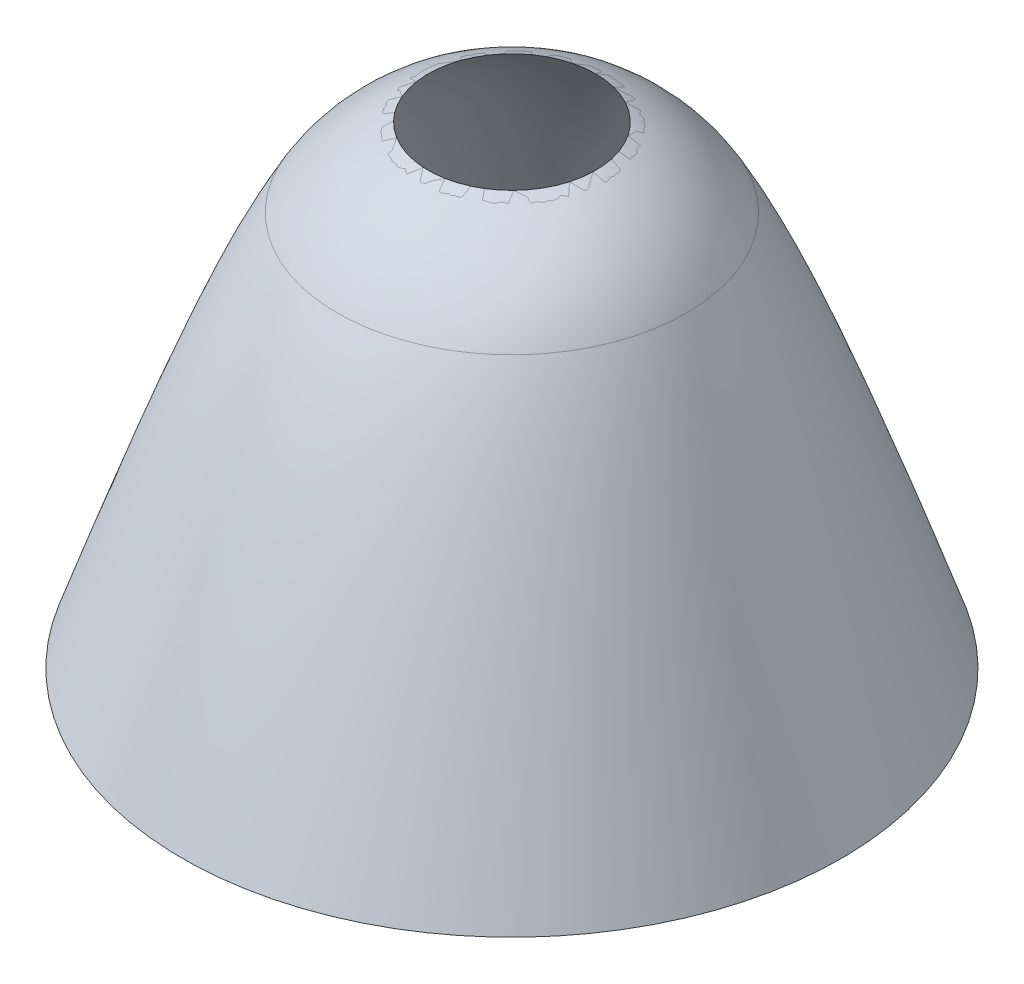
ISO-10303-21;
HEADER;
FILE_DESCRIPTION(('STEP AP214'),'2;1');
FILE_NAME('part.step','',(''),(''),'','','');
FILE_SCHEMA(('AUTOMOTIVE_DESIGN { 1 0 10303 214 1 1 1 1 }'));
ENDSEC;
DATA;
#1=APPLICATION_CONTEXT('core data for automotive mechanical design processes');
#2=APPLICATION_PROTOCOL_DEFINITION('international standard','automotive_design',2000,#1);
#3=PRODUCT_CONTEXT('',#1,'mechanical');
#4=PRODUCT('Part','Part','',(#3));
#5=PRODUCT_RELATED_PRODUCT_CATEGORY('part','',(#4));
#6=PRODUCT_DEFINITION_FORMATION('','',#4);
#7=PRODUCT_DEFINITION_CONTEXT('part definition',#1,'design');
#8=PRODUCT_DEFINITION('design','',#6,#7);
#9=PRODUCT_DEFINITION_SHAPE('','',#8);
#10=(LENGTH_UNIT() NAMED_UNIT(*) SI_UNIT(.MILLI.,.METRE.));
#11=(NAMED_UNIT(*) PLANE_ANGLE_UNIT() SI_UNIT($,.RADIAN.));
#12=(NAMED_UNIT(*) SI_UNIT($,.STERADIAN.) SOLID_ANGLE_UNIT());
#13=UNCERTAINTY_MEASURE_WITH_UNIT(LENGTH_MEASURE(1.E-05),#10,'distance_accuracy_value','');
#14=(GEOMETRIC_REPRESENTATION_CONTEXT(3) GLOBAL_UNCERTAINTY_ASSIGNED_CONTEXT((#13)) GLOBAL_UNIT_ASSIGNED_CONTEXT((#10,
#11,#12)) REPRESENTATION_CONTEXT('',''));
#15=CARTESIAN_POINT('',(0.,0.,0.));
#16=DIRECTION('',(0.,0.,1.));
#17=DIRECTION('',(1.,0.,0.));
#18=AXIS2_PLACEMENT_3D('',#15,#16,#17);
#19=CARTESIAN_POINT('',(2.54,147.434946219845,0.));
#20=CARTESIAN_POINT('',(4.44391074022997,147.396588888388,0.));
#21=CARTESIAN_POINT('',(6.1951511666983,147.315648014619,0.));
#22=CARTESIAN_POINT('',(9.46015977437336,147.082588762057,0.));
#23=CARTESIAN_POINT('',(10.9736874243699,146.930421646242,0.));
#24=CARTESIAN_POINT('',(13.8128483060528,146.564686484713,0.));
#25=CARTESIAN_POINT('',(15.1383297679482,146.351089938964,0.));
#26=CARTESIAN_POINT('',(17.6391410931583,145.8693356398,0.));
#27=CARTESIAN_POINT('',(18.8143736011261,145.601161217029,0.));
#28=CARTESIAN_POINT('',(22.1591351701387,144.721622348052,0.));
#29=CARTESIAN_POINT('',(24.1497355953582,144.036031822629,0.));
#30=CARTESIAN_POINT('',(27.8243773680305,142.481056851854,0.));
#31=CARTESIAN_POINT('',(29.5075494273362,141.611424789934,0.));
#32=CARTESIAN_POINT('',(32.6812485411515,139.67991379499,0.));
#33=CARTESIAN_POINT('',(34.171278065197,138.617804479911,0.));
#34=CARTESIAN_POINT('',(37.0365744966236,136.277622775241,0.));
#35=CARTESIAN_POINT('',(38.4114335520127,134.999454163229,0.));
#36=CARTESIAN_POINT('',(41.1011109649139,132.1935089249,0.));
#37=CARTESIAN_POINT('',(42.415611139186,130.665801647985,0.));
#38=CARTESIAN_POINT('',(45.0270890632609,127.317603968334,0.));
#39=CARTESIAN_POINT('',(46.3238444960167,125.497297619082,0.));
#40=CARTESIAN_POINT('',(48.9382190667018,121.507198540517,0.));
#41=CARTESIAN_POINT('',(50.2556680659783,119.337684699974,0.));
#42=CARTESIAN_POINT('',(52.9513756963385,114.57197873681,0.));
#43=CARTESIAN_POINT('',(54.3294601060289,111.976204432794,0.));
#44=CARTESIAN_POINT('',(57.1928896917786,106.250080594416,0.));
#45=CARTESIAN_POINT('',(58.6779982931963,103.120400448557,0.));
#46=CARTESIAN_POINT('',(61.8143555735089,96.1720775661928,0.));
#47=CARTESIAN_POINT('',(63.4652249709555,92.3545779790196,0.));
#48=CARTESIAN_POINT('',(66.126274037559,85.9413310163367,0.));
#49=CARTESIAN_POINT('',(67.044281242768,83.6884136597265,0.));
#50=CARTESIAN_POINT('',(68.9555569688137,78.9132068300811,0.));
#51=CARTESIAN_POINT('',(69.9487972271433,76.3910052017175,0.));
#52=CARTESIAN_POINT('',(72.0267612997828,71.0286967862614,0.));
#53=CARTESIAN_POINT('',(73.1114456198591,68.1887132489633,0.));
#54=CARTESIAN_POINT('',(75.3925045173663,62.1295659170259,0.));
#55=CARTESIAN_POINT('',(76.5888226959595,58.9105785827812,0.));
#56=CARTESIAN_POINT('',(79.118753882139,52.0149892887281,0.));
#57=CARTESIAN_POINT('',(80.4522844146868,48.3386458021344,0.));
#58=CARTESIAN_POINT('',(83.2896851688076,40.4263543531513,0.));
#59=CARTESIAN_POINT('',(84.7934315368229,36.1907949436504,0.));
#60=CARTESIAN_POINT('',(88.0147755990581,27.0250359138464,0.));
#61=CARTESIAN_POINT('',(89.7321816046056,22.0954380400531,0.));
#62=CARTESIAN_POINT('',(93.439437069474,11.3590411387707,0.));
#63=CARTESIAN_POINT('',(95.4289793562094,5.55320674975051,0.));
#64=CARTESIAN_POINT('',(97.5952124571818,-0.817677732304247,0.));
#65=B_SPLINE_CURVE_WITH_KNOTS('',3,(#19,#20,#21,#22,#23,#24,#25,#26,#27,#28,#29,#30,#31,#32,#33,
#34,#35,#36,#37,#38,#39,#40,#41,#42,#43,#44,#45,#46,#47,#48,#49,#50,#51,#52,#53,#54,#55,#56,#57,
#58,#59,#60,#61,#62,#63,#64),.UNSPECIFIED.,.F.,.F.,(4,2,2,2,2,2,2,2,2,2,2,2,2,2,2,2,2,2,2,2,2,2,
4),(0.,0.03125,0.0625,0.09375,0.125,0.1875,0.25,0.3125,0.375,0.4375,0.5,0.5625,0.625,0.6875,
0.75,0.78125,0.8125,0.84375,0.875,0.90625,0.9375,0.96875,1.),.UNSPECIFIED.);
#66=CARTESIAN_POINT('',(0.,0.,0.));
#67=DIRECTION('',(0.,-1.,0.));
#68=AXIS1_PLACEMENT('',#66,#67);
#69=SURFACE_OF_REVOLUTION('',#65,#68);
#70=CARTESIAN_POINT('',(0.,-0.817677732304247,0.));
#71=DIRECTION('',(0.,-1.,0.));
#72=DIRECTION('',(0.,0.,-1.));
#73=AXIS2_PLACEMENT_3D('',#70,#71,#72);
#74=CIRCLE('',#73,97.5952124571818);
#75=CARTESIAN_POINT('',(0.,-0.817677732304247,-97.5952124571818));
#76=VERTEX_POINT('',#75);
#77=EDGE_CURVE('E45',#76,#76,#74,.T.);
#78=ORIENTED_EDGE('',*,*,#77,.T.);
#79=EDGE_LOOP('',(#78));
#80=FACE_BOUND('',#79,.T.);
#81=CARTESIAN_POINT('',(0.,143.501673848367,0.));
#82=DIRECTION('',(0.,-1.,0.));
#83=DIRECTION('',(0.,0.,-1.));
#84=AXIS2_PLACEMENT_3D('',#81,#82,#83);
#85=CIRCLE('',#84,25.4);
#86=CARTESIAN_POINT('',(0.,143.501673848367,-25.4));
#87=VERTEX_POINT('',#86);
#88=EDGE_CURVE('E53',#87,#87,#85,.F.);
#89=ORIENTED_EDGE('',*,*,#88,.T.);
#90=EDGE_LOOP('',(#89));
#91=FACE_BOUND('',#90,.T.);
#92=ADVANCED_FACE('F38',(#80,#91),#69,.F.);
#93=CARTESIAN_POINT('',(0.,150.,0.));
#94=CARTESIAN_POINT('',(48.9968832332281,150.,0.));
#95=CARTESIAN_POINT('',(100.,0.,0.));
#96=(BOUNDED_CURVE() B_SPLINE_CURVE(2,(#93,#94,#95),.UNSPECIFIED.,.F.,
.F.) B_SPLINE_CURVE_WITH_KNOTS((3,3),(0.,1.),
.UNSPECIFIED.) CURVE() GEOMETRIC_REPRESENTATION_ITEM() RATIONAL_B_SPLINE_CURVE((1.,
2.0671660416001,1.)) REPRESENTATION_ITEM(''));
#97=CARTESIAN_POINT('',(0.,0.,0.));
#98=DIRECTION('',(0.,-1.,0.));
#99=AXIS1_PLACEMENT('',#97,#98);
#100=SURFACE_OF_REVOLUTION('',#96,#99);
#101=CARTESIAN_POINT('',(0.,119.753201865018,0.));
#102=DIRECTION('',(0.,-1.,0.));
#103=DIRECTION('',(0.,0.,-1.));
#104=AXIS2_PLACEMENT_3D('',#101,#102,#103);
#105=CIRCLE('',#104,52.9258427002743);
#106=CARTESIAN_POINT('',(0.,119.753201865018,-52.9258427002743));
#107=VERTEX_POINT('',#106);
#108=EDGE_CURVE('E10',#107,#107,#105,.T.);
#109=ORIENTED_EDGE('',*,*,#108,.T.);
#110=EDGE_LOOP('',(#109));
#111=FACE_BOUND('',#110,.T.);
#112=CARTESIAN_POINT('',(0.,0.,0.));
#113=DIRECTION('',(0.,-1.,0.));
#114=DIRECTION('',(0.,0.,-1.));
#115=AXIS2_PLACEMENT_3D('',#112,#113,#114);
#116=CIRCLE('',#115,100.);
#117=CARTESIAN_POINT('',(0.,0.,-100.));
#118=VERTEX_POINT('',#117);
#119=EDGE_CURVE('E49',#118,#118,#116,.T.);
#120=ORIENTED_EDGE('',*,*,#119,.F.);
#121=EDGE_LOOP('',(#120));
#122=FACE_BOUND('',#121,.T.);
#123=ADVANCED_FACE('F68',(#111,#122),#100,.T.);
#124=CARTESIAN_POINT('',(0.,0.,0.));
#125=DIRECTION('',(0.,1.,0.));
#126=DIRECTION('',(0.,0.,1.));
#127=AXIS2_PLACEMENT_3D('',#124,#125,#126);
#128=CONICAL_SURFACE('',#127,100.,1.24303919477809);
#129=ORIENTED_EDGE('',*,*,#77,.F.);
#130=EDGE_LOOP('',(#129));
#131=FACE_BOUND('',#130,.T.);
#132=ORIENTED_EDGE('',*,*,#119,.T.);
#133=EDGE_LOOP('',(#132));
#134=FACE_BOUND('',#133,.T.);
#135=ADVANCED_FACE('F71',(#131,#134),#128,.T.);
#136=CARTESIAN_POINT('',(0.,91.6191009761416,0.));
#137=DIRECTION('',(0.,-1.,0.));
#138=DIRECTION('',(0.,0.,-1.));
#139=AXIS2_PLACEMENT_3D('',#136,#137,#138);
#140=DEGENERATE_TOROIDAL_SURFACE('',#139,4.64492755593884,55.88,.T.);
#141=ORIENTED_EDGE('',*,*,#108,.F.);
#142=EDGE_LOOP('',(#141));
#143=FACE_BOUND('',#142,.T.);
#144=ORIENTED_EDGE('',*,*,#88,.F.);
#145=EDGE_LOOP('',(#144));
#146=FACE_BOUND('',#145,.T.);
#147=ADVANCED_FACE('F40',(#143,#146),#140,.T.);
#148=CLOSED_SHELL('',(#92,#123,#135,#147));
#149=MANIFOLD_SOLID_BREP('B2',#148);
#150=ADVANCED_BREP_SHAPE_REPRESENTATION('',(#18,#149),#14);
#151=SHAPE_DEFINITION_REPRESENTATION(#9,#150);
ENDSEC;
END-ISO-10303-21;
